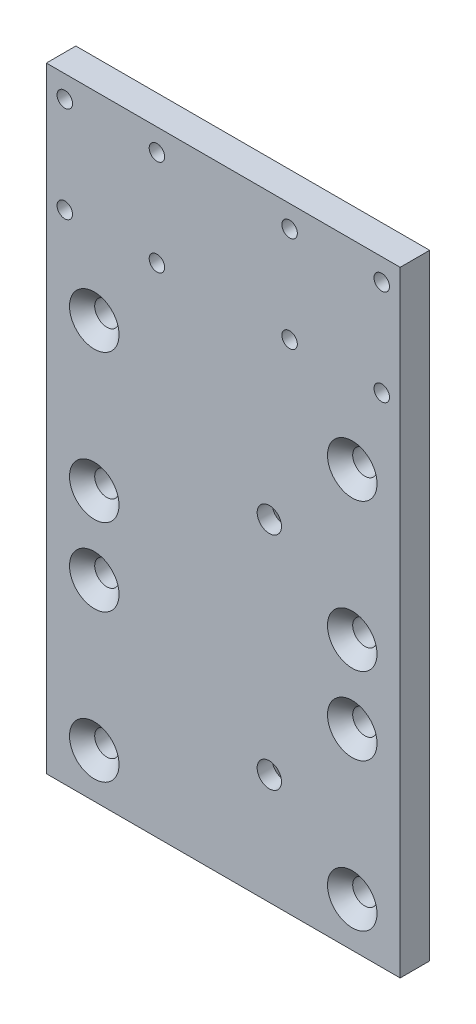
ISO-10303-21;
HEADER;
FILE_DESCRIPTION(('STEP AP214'),'2;1');
FILE_NAME('part.step','',(''),(''),'','','');
FILE_SCHEMA(('AUTOMOTIVE_DESIGN { 1 0 10303 214 1 1 1 1 }'));
ENDSEC;
DATA;
#1=APPLICATION_CONTEXT('core data for automotive mechanical design processes');
#2=APPLICATION_PROTOCOL_DEFINITION('international standard','automotive_design',2000,#1);
#3=PRODUCT_CONTEXT('',#1,'mechanical');
#4=PRODUCT('Part','Part','',(#3));
#5=PRODUCT_RELATED_PRODUCT_CATEGORY('part','',(#4));
#6=PRODUCT_DEFINITION_FORMATION('','',#4);
#7=PRODUCT_DEFINITION_CONTEXT('part definition',#1,'design');
#8=PRODUCT_DEFINITION('design','',#6,#7);
#9=PRODUCT_DEFINITION_SHAPE('','',#8);
#10=(LENGTH_UNIT() NAMED_UNIT(*) SI_UNIT(.MILLI.,.METRE.));
#11=(NAMED_UNIT(*) PLANE_ANGLE_UNIT() SI_UNIT($,.RADIAN.));
#12=(NAMED_UNIT(*) SI_UNIT($,.STERADIAN.) SOLID_ANGLE_UNIT());
#13=UNCERTAINTY_MEASURE_WITH_UNIT(LENGTH_MEASURE(1.E-05),#10,'distance_accuracy_value','');
#14=(GEOMETRIC_REPRESENTATION_CONTEXT(3) GLOBAL_UNCERTAINTY_ASSIGNED_CONTEXT((#13)) GLOBAL_UNIT_ASSIGNED_CONTEXT((#10,
#11,#12)) REPRESENTATION_CONTEXT('',''));
#15=CARTESIAN_POINT('',(0.,0.,0.));
#16=DIRECTION('',(0.,0.,1.));
#17=DIRECTION('',(1.,0.,0.));
#18=AXIS2_PLACEMENT_3D('',#15,#16,#17);
#19=CARTESIAN_POINT('',(20.,-60.,8.));
#20=DIRECTION('',(0.,0.,1.));
#21=DIRECTION('',(1.,0.,0.));
#22=AXIS2_PLACEMENT_3D('',#19,#20,#21);
#23=PLANE('',#22);
#24=CARTESIAN_POINT('',(12.5,30.,8.));
#25=DIRECTION('',(0.,0.,1.));
#26=DIRECTION('',(1.,0.,0.));
#27=AXIS2_PLACEMENT_3D('',#24,#25,#26);
#28=CIRCLE('',#27,3.3);
#29=CARTESIAN_POINT('',(15.8,30.,8.));
#30=VERTEX_POINT('',#29);
#31=EDGE_CURVE('E48',#30,#30,#28,.T.);
#32=ORIENTED_EDGE('',*,*,#31,.F.);
#33=EDGE_LOOP('',(#32));
#34=FACE_BOUND('',#33,.T.);
#35=CARTESIAN_POINT('',(12.5,-30.,8.));
#36=DIRECTION('',(0.,0.,1.));
#37=DIRECTION('',(1.,0.,0.));
#38=AXIS2_PLACEMENT_3D('',#35,#36,#37);
#39=CIRCLE('',#38,3.3);
#40=CARTESIAN_POINT('',(15.8,-30.,8.));
#41=VERTEX_POINT('',#40);
#42=EDGE_CURVE('E104',#41,#41,#39,.T.);
#43=ORIENTED_EDGE('',*,*,#42,.F.);
#44=EDGE_LOOP('',(#43));
#45=FACE_BOUND('',#44,.T.);
#46=DIRECTION('',(0.,-1.,0.));
#47=VECTOR('',#46,1.);
#48=CARTESIAN_POINT('',(-48.,-60.,8.));
#49=LINE('',#48,#47);
#50=CARTESIAN_POINT('',(-48.,107.,8.));
#51=VERTEX_POINT('',#50);
#52=CARTESIAN_POINT('',(-48.,-60.,8.));
#53=VERTEX_POINT('',#52);
#54=EDGE_CURVE('E96',#51,#53,#49,.T.);
#55=ORIENTED_EDGE('',*,*,#54,.T.);
#56=DIRECTION('',(1.,0.,0.));
#57=VECTOR('',#56,1.);
#58=CARTESIAN_POINT('',(-48.,-60.,8.));
#59=LINE('',#58,#57);
#60=CARTESIAN_POINT('',(48.,-60.,8.));
#61=VERTEX_POINT('',#60);
#62=EDGE_CURVE('E91',#53,#61,#59,.T.);
#63=ORIENTED_EDGE('',*,*,#62,.T.);
#64=DIRECTION('',(0.,1.,0.));
#65=VECTOR('',#64,1.);
#66=CARTESIAN_POINT('',(48.,-60.,8.));
#67=LINE('',#66,#65);
#68=CARTESIAN_POINT('',(48.,107.,8.));
#69=VERTEX_POINT('',#68);
#70=EDGE_CURVE('E63',#61,#69,#67,.T.);
#71=ORIENTED_EDGE('',*,*,#70,.T.);
#72=DIRECTION('',(-1.,0.,0.));
#73=VECTOR('',#72,1.);
#74=CARTESIAN_POINT('',(-48.,107.,8.));
#75=LINE('',#74,#73);
#76=EDGE_CURVE('E100',#69,#51,#75,.T.);
#77=ORIENTED_EDGE('',*,*,#76,.T.);
#78=EDGE_LOOP('',(#55,#63,#71,#77));
#79=FACE_BOUND('',#78,.T.);
#80=CARTESIAN_POINT('',(35.,53.,8.));
#81=DIRECTION('',(0.,0.,1.));
#82=DIRECTION('',(1.,0.,0.));
#83=AXIS2_PLACEMENT_3D('',#80,#81,#82);
#84=CIRCLE('',#83,6.72);
#85=CARTESIAN_POINT('',(41.72,53.,8.));
#86=VERTEX_POINT('',#85);
#87=EDGE_CURVE('E12',#86,#86,#84,.T.);
#88=ORIENTED_EDGE('',*,*,#87,.F.);
#89=EDGE_LOOP('',(#88));
#90=FACE_BOUND('',#89,.T.);
#91=CARTESIAN_POINT('',(35.,13.,8.));
#92=DIRECTION('',(0.,0.,1.));
#93=DIRECTION('',(1.,0.,0.));
#94=AXIS2_PLACEMENT_3D('',#91,#92,#93);
#95=CIRCLE('',#94,6.72);
#96=CARTESIAN_POINT('',(41.72,13.,8.));
#97=VERTEX_POINT('',#96);
#98=EDGE_CURVE('E234',#97,#97,#95,.T.);
#99=ORIENTED_EDGE('',*,*,#98,.F.);
#100=EDGE_LOOP('',(#99));
#101=FACE_BOUND('',#100,.T.);
#102=CARTESIAN_POINT('',(35.,-8.00000000000001,8.));
#103=DIRECTION('',(0.,0.,1.));
#104=DIRECTION('',(1.,0.,0.));
#105=AXIS2_PLACEMENT_3D('',#102,#103,#104);
#106=CIRCLE('',#105,6.72);
#107=CARTESIAN_POINT('',(41.72,-8.00000000000001,8.));
#108=VERTEX_POINT('',#107);
#109=EDGE_CURVE('E225',#108,#108,#106,.T.);
#110=ORIENTED_EDGE('',*,*,#109,.F.);
#111=EDGE_LOOP('',(#110));
#112=FACE_BOUND('',#111,.T.);
#113=CARTESIAN_POINT('',(35.,-48.,8.));
#114=DIRECTION('',(0.,0.,1.));
#115=DIRECTION('',(1.,0.,0.));
#116=AXIS2_PLACEMENT_3D('',#113,#114,#115);
#117=CIRCLE('',#116,6.72);
#118=CARTESIAN_POINT('',(41.72,-48.,8.));
#119=VERTEX_POINT('',#118);
#120=EDGE_CURVE('E216',#119,#119,#117,.T.);
#121=ORIENTED_EDGE('',*,*,#120,.F.);
#122=EDGE_LOOP('',(#121));
#123=FACE_BOUND('',#122,.T.);
#124=CARTESIAN_POINT('',(-43.0000000000005,101.000000000001,8.));
#125=DIRECTION('',(0.,0.,1.));
#126=DIRECTION('',(1.,0.,0.));
#127=AXIS2_PLACEMENT_3D('',#124,#125,#126);
#128=CIRCLE('',#127,2.1);
#129=CARTESIAN_POINT('',(-40.9000000000005,101.000000000001,8.));
#130=VERTEX_POINT('',#129);
#131=EDGE_CURVE('E207',#130,#130,#128,.T.);
#132=ORIENTED_EDGE('',*,*,#131,.F.);
#133=EDGE_LOOP('',(#132));
#134=FACE_BOUND('',#133,.T.);
#135=CARTESIAN_POINT('',(-43.0000000000005,75.0000000000006,8.));
#136=DIRECTION('',(0.,0.,1.));
#137=DIRECTION('',(1.,0.,0.));
#138=AXIS2_PLACEMENT_3D('',#135,#136,#137);
#139=CIRCLE('',#138,2.1);
#140=CARTESIAN_POINT('',(-40.9000000000005,75.0000000000006,8.));
#141=VERTEX_POINT('',#140);
#142=EDGE_CURVE('E201',#141,#141,#139,.T.);
#143=ORIENTED_EDGE('',*,*,#142,.F.);
#144=EDGE_LOOP('',(#143));
#145=FACE_BOUND('',#144,.T.);
#146=CARTESIAN_POINT('',(-18.0000000000005,101.000000000001,8.));
#147=DIRECTION('',(0.,0.,1.));
#148=DIRECTION('',(1.,0.,0.));
#149=AXIS2_PLACEMENT_3D('',#146,#147,#148);
#150=CIRCLE('',#149,2.1);
#151=CARTESIAN_POINT('',(-15.9000000000004,101.000000000001,8.));
#152=VERTEX_POINT('',#151);
#153=EDGE_CURVE('E195',#152,#152,#150,.T.);
#154=ORIENTED_EDGE('',*,*,#153,.F.);
#155=EDGE_LOOP('',(#154));
#156=FACE_BOUND('',#155,.T.);
#157=CARTESIAN_POINT('',(-18.0000000000005,75.0000000000006,8.));
#158=DIRECTION('',(0.,0.,1.));
#159=DIRECTION('',(1.,0.,0.));
#160=AXIS2_PLACEMENT_3D('',#157,#158,#159);
#161=CIRCLE('',#160,2.1);
#162=CARTESIAN_POINT('',(-15.9000000000004,75.0000000000006,8.));
#163=VERTEX_POINT('',#162);
#164=EDGE_CURVE('E189',#163,#163,#161,.T.);
#165=ORIENTED_EDGE('',*,*,#164,.F.);
#166=EDGE_LOOP('',(#165));
#167=FACE_BOUND('',#166,.T.);
#168=CARTESIAN_POINT('',(18.0000000000004,75.0000000000004,8.));
#169=DIRECTION('',(0.,0.,1.));
#170=DIRECTION('',(1.,0.,0.));
#171=AXIS2_PLACEMENT_3D('',#168,#169,#170);
#172=CIRCLE('',#171,2.1);
#173=CARTESIAN_POINT('',(20.1000000000004,75.0000000000004,8.));
#174=VERTEX_POINT('',#173);
#175=EDGE_CURVE('E183',#174,#174,#172,.T.);
#176=ORIENTED_EDGE('',*,*,#175,.F.);
#177=EDGE_LOOP('',(#176));
#178=FACE_BOUND('',#177,.T.);
#179=CARTESIAN_POINT('',(18.0000000000004,101.,8.));
#180=DIRECTION('',(0.,0.,1.));
#181=DIRECTION('',(1.,0.,0.));
#182=AXIS2_PLACEMENT_3D('',#179,#180,#181);
#183=CIRCLE('',#182,2.1);
#184=CARTESIAN_POINT('',(20.1000000000004,101.,8.));
#185=VERTEX_POINT('',#184);
#186=EDGE_CURVE('E177',#185,#185,#183,.T.);
#187=ORIENTED_EDGE('',*,*,#186,.F.);
#188=EDGE_LOOP('',(#187));
#189=FACE_BOUND('',#188,.T.);
#190=CARTESIAN_POINT('',(43.0000000000004,101.,8.));
#191=DIRECTION('',(0.,0.,1.));
#192=DIRECTION('',(1.,0.,0.));
#193=AXIS2_PLACEMENT_3D('',#190,#191,#192);
#194=CIRCLE('',#193,2.1);
#195=CARTESIAN_POINT('',(45.1000000000004,101.,8.));
#196=VERTEX_POINT('',#195);
#197=EDGE_CURVE('E171',#196,#196,#194,.T.);
#198=ORIENTED_EDGE('',*,*,#197,.F.);
#199=EDGE_LOOP('',(#198));
#200=FACE_BOUND('',#199,.T.);
#201=CARTESIAN_POINT('',(43.0000000000004,75.0000000000004,8.));
#202=DIRECTION('',(0.,0.,1.));
#203=DIRECTION('',(1.,0.,0.));
#204=AXIS2_PLACEMENT_3D('',#201,#202,#203);
#205=CIRCLE('',#204,2.1);
#206=CARTESIAN_POINT('',(45.1000000000004,75.0000000000004,8.));
#207=VERTEX_POINT('',#206);
#208=EDGE_CURVE('E165',#207,#207,#205,.T.);
#209=ORIENTED_EDGE('',*,*,#208,.F.);
#210=EDGE_LOOP('',(#209));
#211=FACE_BOUND('',#210,.T.);
#212=CARTESIAN_POINT('',(-35.,-48.,8.));
#213=DIRECTION('',(0.,0.,1.));
#214=DIRECTION('',(1.,0.,0.));
#215=AXIS2_PLACEMENT_3D('',#212,#213,#214);
#216=CIRCLE('',#215,6.72);
#217=CARTESIAN_POINT('',(-28.28,-48.,8.));
#218=VERTEX_POINT('',#217);
#219=EDGE_CURVE('E124',#218,#218,#216,.T.);
#220=ORIENTED_EDGE('',*,*,#219,.F.);
#221=EDGE_LOOP('',(#220));
#222=FACE_BOUND('',#221,.T.);
#223=CARTESIAN_POINT('',(-35.,-8.00000000000001,8.));
#224=DIRECTION('',(0.,0.,1.));
#225=DIRECTION('',(1.,0.,0.));
#226=AXIS2_PLACEMENT_3D('',#223,#224,#225);
#227=CIRCLE('',#226,6.72);
#228=CARTESIAN_POINT('',(-28.28,-8.00000000000001,8.));
#229=VERTEX_POINT('',#228);
#230=EDGE_CURVE('E133',#229,#229,#227,.T.);
#231=ORIENTED_EDGE('',*,*,#230,.F.);
#232=EDGE_LOOP('',(#231));
#233=FACE_BOUND('',#232,.T.);
#234=CARTESIAN_POINT('',(-35.,13.,8.));
#235=DIRECTION('',(0.,0.,1.));
#236=DIRECTION('',(1.,0.,0.));
#237=AXIS2_PLACEMENT_3D('',#234,#235,#236);
#238=CIRCLE('',#237,6.72);
#239=CARTESIAN_POINT('',(-28.28,13.,8.));
#240=VERTEX_POINT('',#239);
#241=EDGE_CURVE('E142',#240,#240,#238,.T.);
#242=ORIENTED_EDGE('',*,*,#241,.F.);
#243=EDGE_LOOP('',(#242));
#244=FACE_BOUND('',#243,.T.);
#245=CARTESIAN_POINT('',(-35.,53.,8.));
#246=DIRECTION('',(0.,0.,1.));
#247=DIRECTION('',(1.,0.,0.));
#248=AXIS2_PLACEMENT_3D('',#245,#246,#247);
#249=CIRCLE('',#248,6.72);
#250=CARTESIAN_POINT('',(-28.28,53.,8.));
#251=VERTEX_POINT('',#250);
#252=EDGE_CURVE('E151',#251,#251,#249,.T.);
#253=ORIENTED_EDGE('',*,*,#252,.F.);
#254=EDGE_LOOP('',(#253));
#255=FACE_BOUND('',#254,.T.);
#256=ADVANCED_FACE('F44',(#34,#45,#79,#90,#101,#112,#123,#134,#145,#156,#167,#178,#189,#200,
#211,#222,#233,#244,#255),#23,.T.);
#257=CARTESIAN_POINT('',(-35.,-48.,8.));
#258=DIRECTION('',(0.,0.,1.));
#259=DIRECTION('',(1.,0.,0.));
#260=AXIS2_PLACEMENT_3D('',#257,#258,#259);
#261=CYLINDRICAL_SURFACE('',#260,3.3);
#262=CARTESIAN_POINT('',(-35.,-48.,0.));
#263=DIRECTION('',(0.,0.,1.));
#264=DIRECTION('',(1.,0.,0.));
#265=AXIS2_PLACEMENT_3D('',#262,#263,#264);
#266=CIRCLE('',#265,3.3);
#267=CARTESIAN_POINT('',(-31.7,-48.,0.));
#268=VERTEX_POINT('',#267);
#269=EDGE_CURVE('E116',#268,#268,#266,.T.);
#270=ORIENTED_EDGE('',*,*,#269,.F.);
#271=EDGE_LOOP('',(#270));
#272=FACE_BOUND('',#271,.T.);
#273=CARTESIAN_POINT('',(-35.,-48.,4.58));
#274=DIRECTION('',(0.,0.,1.));
#275=DIRECTION('',(1.,0.,0.));
#276=AXIS2_PLACEMENT_3D('',#273,#274,#275);
#277=CIRCLE('',#276,3.3);
#278=CARTESIAN_POINT('',(-31.7,-48.,4.58));
#279=VERTEX_POINT('',#278);
#280=EDGE_CURVE('E121',#279,#279,#277,.T.);
#281=ORIENTED_EDGE('',*,*,#280,.T.);
#282=EDGE_LOOP('',(#281));
#283=FACE_BOUND('',#282,.T.);
#284=ADVANCED_FACE('F253',(#272,#283),#261,.F.);
#285=CARTESIAN_POINT('',(-35.,-48.,8.));
#286=DIRECTION('',(0.,0.,1.));
#287=DIRECTION('',(1.,0.,0.));
#288=AXIS2_PLACEMENT_3D('',#285,#286,#287);
#289=CONICAL_SURFACE('',#288,6.72,0.785398163397449);
#290=ORIENTED_EDGE('',*,*,#280,.F.);
#291=EDGE_LOOP('',(#290));
#292=FACE_BOUND('',#291,.T.);
#293=ORIENTED_EDGE('',*,*,#219,.T.);
#294=EDGE_LOOP('',(#293));
#295=FACE_BOUND('',#294,.T.);
#296=ADVANCED_FACE('F304',(#292,#295),#289,.F.);
#297=CARTESIAN_POINT('',(-35.,-8.00000000000001,8.));
#298=DIRECTION('',(0.,0.,1.));
#299=DIRECTION('',(1.,0.,0.));
#300=AXIS2_PLACEMENT_3D('',#297,#298,#299);
#301=CYLINDRICAL_SURFACE('',#300,3.3);
#302=CARTESIAN_POINT('',(-35.,-8.00000000000001,0.));
#303=DIRECTION('',(0.,0.,1.));
#304=DIRECTION('',(1.,0.,0.));
#305=AXIS2_PLACEMENT_3D('',#302,#303,#304);
#306=CIRCLE('',#305,3.3);
#307=CARTESIAN_POINT('',(-31.7,-8.00000000000001,0.));
#308=VERTEX_POINT('',#307);
#309=EDGE_CURVE('E127',#308,#308,#306,.T.);
#310=ORIENTED_EDGE('',*,*,#309,.F.);
#311=EDGE_LOOP('',(#310));
#312=FACE_BOUND('',#311,.T.);
#313=CARTESIAN_POINT('',(-35.,-8.00000000000001,4.58));
#314=DIRECTION('',(0.,0.,1.));
#315=DIRECTION('',(1.,0.,0.));
#316=AXIS2_PLACEMENT_3D('',#313,#314,#315);
#317=CIRCLE('',#316,3.3);
#318=CARTESIAN_POINT('',(-31.7,-8.00000000000001,4.58));
#319=VERTEX_POINT('',#318);
#320=EDGE_CURVE('E130',#319,#319,#317,.T.);
#321=ORIENTED_EDGE('',*,*,#320,.T.);
#322=EDGE_LOOP('',(#321));
#323=FACE_BOUND('',#322,.T.);
#324=ADVANCED_FACE('F310',(#312,#323),#301,.F.);
#325=CARTESIAN_POINT('',(-35.,-8.00000000000001,8.));
#326=DIRECTION('',(0.,0.,1.));
#327=DIRECTION('',(1.,0.,0.));
#328=AXIS2_PLACEMENT_3D('',#325,#326,#327);
#329=CONICAL_SURFACE('',#328,6.72,0.785398163397449);
#330=ORIENTED_EDGE('',*,*,#320,.F.);
#331=EDGE_LOOP('',(#330));
#332=FACE_BOUND('',#331,.T.);
#333=ORIENTED_EDGE('',*,*,#230,.T.);
#334=EDGE_LOOP('',(#333));
#335=FACE_BOUND('',#334,.T.);
#336=ADVANCED_FACE('F319',(#332,#335),#329,.F.);
#337=CARTESIAN_POINT('',(-35.,13.,8.));
#338=DIRECTION('',(0.,0.,1.));
#339=DIRECTION('',(1.,0.,0.));
#340=AXIS2_PLACEMENT_3D('',#337,#338,#339);
#341=CYLINDRICAL_SURFACE('',#340,3.3);
#342=CARTESIAN_POINT('',(-35.,13.,0.));
#343=DIRECTION('',(0.,0.,1.));
#344=DIRECTION('',(1.,0.,0.));
#345=AXIS2_PLACEMENT_3D('',#342,#343,#344);
#346=CIRCLE('',#345,3.3);
#347=CARTESIAN_POINT('',(-31.7,13.,0.));
#348=VERTEX_POINT('',#347);
#349=EDGE_CURVE('E136',#348,#348,#346,.T.);
#350=ORIENTED_EDGE('',*,*,#349,.F.);
#351=EDGE_LOOP('',(#350));
#352=FACE_BOUND('',#351,.T.);
#353=CARTESIAN_POINT('',(-35.,13.,4.58));
#354=DIRECTION('',(0.,0.,1.));
#355=DIRECTION('',(1.,0.,0.));
#356=AXIS2_PLACEMENT_3D('',#353,#354,#355);
#357=CIRCLE('',#356,3.3);
#358=CARTESIAN_POINT('',(-31.7,13.,4.58));
#359=VERTEX_POINT('',#358);
#360=EDGE_CURVE('E139',#359,#359,#357,.T.);
#361=ORIENTED_EDGE('',*,*,#360,.T.);
#362=EDGE_LOOP('',(#361));
#363=FACE_BOUND('',#362,.T.);
#364=ADVANCED_FACE('F323',(#352,#363),#341,.F.);
#365=CARTESIAN_POINT('',(-35.,13.,8.));
#366=DIRECTION('',(0.,0.,1.));
#367=DIRECTION('',(1.,0.,0.));
#368=AXIS2_PLACEMENT_3D('',#365,#366,#367);
#369=CONICAL_SURFACE('',#368,6.72,0.785398163397449);
#370=ORIENTED_EDGE('',*,*,#360,.F.);
#371=EDGE_LOOP('',(#370));
#372=FACE_BOUND('',#371,.T.);
#373=ORIENTED_EDGE('',*,*,#241,.T.);
#374=EDGE_LOOP('',(#373));
#375=FACE_BOUND('',#374,.T.);
#376=ADVANCED_FACE('F298',(#372,#375),#369,.F.);
#377=CARTESIAN_POINT('',(-35.,53.,8.));
#378=DIRECTION('',(0.,0.,1.));
#379=DIRECTION('',(1.,0.,0.));
#380=AXIS2_PLACEMENT_3D('',#377,#378,#379);
#381=CYLINDRICAL_SURFACE('',#380,3.3);
#382=CARTESIAN_POINT('',(-35.,53.,0.));
#383=DIRECTION('',(0.,0.,1.));
#384=DIRECTION('',(1.,0.,0.));
#385=AXIS2_PLACEMENT_3D('',#382,#383,#384);
#386=CIRCLE('',#385,3.3);
#387=CARTESIAN_POINT('',(-31.7,53.,0.));
#388=VERTEX_POINT('',#387);
#389=EDGE_CURVE('E145',#388,#388,#386,.T.);
#390=ORIENTED_EDGE('',*,*,#389,.F.);
#391=EDGE_LOOP('',(#390));
#392=FACE_BOUND('',#391,.T.);
#393=CARTESIAN_POINT('',(-35.,53.,4.58));
#394=DIRECTION('',(0.,0.,1.));
#395=DIRECTION('',(1.,0.,0.));
#396=AXIS2_PLACEMENT_3D('',#393,#394,#395);
#397=CIRCLE('',#396,3.3);
#398=CARTESIAN_POINT('',(-31.7,53.,4.58));
#399=VERTEX_POINT('',#398);
#400=EDGE_CURVE('E148',#399,#399,#397,.T.);
#401=ORIENTED_EDGE('',*,*,#400,.T.);
#402=EDGE_LOOP('',(#401));
#403=FACE_BOUND('',#402,.T.);
#404=ADVANCED_FACE('F289',(#392,#403),#381,.F.);
#405=CARTESIAN_POINT('',(-35.,53.,8.));
#406=DIRECTION('',(0.,0.,1.));
#407=DIRECTION('',(1.,0.,0.));
#408=AXIS2_PLACEMENT_3D('',#405,#406,#407);
#409=CONICAL_SURFACE('',#408,6.72,0.785398163397449);
#410=ORIENTED_EDGE('',*,*,#400,.F.);
#411=EDGE_LOOP('',(#410));
#412=FACE_BOUND('',#411,.T.);
#413=ORIENTED_EDGE('',*,*,#252,.T.);
#414=EDGE_LOOP('',(#413));
#415=FACE_BOUND('',#414,.T.);
#416=ADVANCED_FACE('F287',(#412,#415),#409,.F.);
#417=CARTESIAN_POINT('',(-48.,-60.,8.));
#418=DIRECTION('',(1.,0.,0.));
#419=DIRECTION('',(0.,0.,-1.));
#420=AXIS2_PLACEMENT_3D('',#417,#418,#419);
#421=PLANE('',#420);
#422=DIRECTION('',(0.,-1.,0.));
#423=VECTOR('',#422,1.);
#424=CARTESIAN_POINT('',(-48.,-60.,0.));
#425=LINE('',#424,#423);
#426=CARTESIAN_POINT('',(-48.,107.,0.));
#427=VERTEX_POINT('',#426);
#428=CARTESIAN_POINT('',(-48.,-60.,0.));
#429=VERTEX_POINT('',#428);
#430=EDGE_CURVE('E75',#427,#429,#425,.T.);
#431=ORIENTED_EDGE('',*,*,#430,.T.);
#432=DIRECTION('',(0.,0.,-1.));
#433=VECTOR('',#432,1.);
#434=CARTESIAN_POINT('',(-48.,-60.,8.));
#435=LINE('',#434,#433);
#436=EDGE_CURVE('E93',#53,#429,#435,.T.);
#437=ORIENTED_EDGE('',*,*,#436,.F.);
#438=ORIENTED_EDGE('',*,*,#54,.F.);
#439=DIRECTION('',(0.,0.,1.));
#440=VECTOR('',#439,1.);
#441=CARTESIAN_POINT('',(-48.,107.,0.));
#442=LINE('',#441,#440);
#443=EDGE_CURVE('E154',#427,#51,#442,.T.);
#444=ORIENTED_EDGE('',*,*,#443,.F.);
#445=EDGE_LOOP('',(#431,#437,#438,#444));
#446=FACE_BOUND('',#445,.T.);
#447=ADVANCED_FACE('F103',(#446),#421,.F.);
#448=CARTESIAN_POINT('',(0.,0.,0.));
#449=DIRECTION('',(0.,0.,-1.));
#450=DIRECTION('',(-1.,0.,0.));
#451=AXIS2_PLACEMENT_3D('',#448,#449,#450);
#452=PLANE('',#451);
#453=CARTESIAN_POINT('',(12.5,30.,0.));
#454=DIRECTION('',(0.,0.,-1.));
#455=DIRECTION('',(-1.,0.,0.));
#456=AXIS2_PLACEMENT_3D('',#453,#454,#455);
#457=CIRCLE('',#456,7.22);
#458=CARTESIAN_POINT('',(5.28,30.,0.));
#459=VERTEX_POINT('',#458);
#460=EDGE_CURVE('E615',#459,#459,#457,.T.);
#461=ORIENTED_EDGE('',*,*,#460,.F.);
#462=EDGE_LOOP('',(#461));
#463=FACE_BOUND('',#462,.T.);
#464=CARTESIAN_POINT('',(12.5,-30.,0.));
#465=DIRECTION('',(0.,0.,-1.));
#466=DIRECTION('',(-1.,0.,0.));
#467=AXIS2_PLACEMENT_3D('',#464,#465,#466);
#468=CIRCLE('',#467,7.22);
#469=CARTESIAN_POINT('',(5.27999999999998,-30.,0.));
#470=VERTEX_POINT('',#469);
#471=EDGE_CURVE('E618',#470,#470,#468,.T.);
#472=ORIENTED_EDGE('',*,*,#471,.F.);
#473=EDGE_LOOP('',(#472));
#474=FACE_BOUND('',#473,.T.);
#475=CARTESIAN_POINT('',(35.,53.,0.));
#476=DIRECTION('',(0.,0.,1.));
#477=DIRECTION('',(1.,0.,0.));
#478=AXIS2_PLACEMENT_3D('',#475,#476,#477);
#479=CIRCLE('',#478,3.3);
#480=CARTESIAN_POINT('',(38.3,53.,0.));
#481=VERTEX_POINT('',#480);
#482=EDGE_CURVE('E237',#481,#481,#479,.T.);
#483=ORIENTED_EDGE('',*,*,#482,.T.);
#484=EDGE_LOOP('',(#483));
#485=FACE_BOUND('',#484,.T.);
#486=CARTESIAN_POINT('',(35.,13.,0.));
#487=DIRECTION('',(0.,0.,1.));
#488=DIRECTION('',(1.,0.,0.));
#489=AXIS2_PLACEMENT_3D('',#486,#487,#488);
#490=CIRCLE('',#489,3.3);
#491=CARTESIAN_POINT('',(38.3,13.,0.));
#492=VERTEX_POINT('',#491);
#493=EDGE_CURVE('E228',#492,#492,#490,.T.);
#494=ORIENTED_EDGE('',*,*,#493,.T.);
#495=EDGE_LOOP('',(#494));
#496=FACE_BOUND('',#495,.T.);
#497=CARTESIAN_POINT('',(35.,-8.00000000000001,0.));
#498=DIRECTION('',(0.,0.,1.));
#499=DIRECTION('',(1.,0.,0.));
#500=AXIS2_PLACEMENT_3D('',#497,#498,#499);
#501=CIRCLE('',#500,3.3);
#502=CARTESIAN_POINT('',(38.3,-8.00000000000001,0.));
#503=VERTEX_POINT('',#502);
#504=EDGE_CURVE('E219',#503,#503,#501,.T.);
#505=ORIENTED_EDGE('',*,*,#504,.T.);
#506=EDGE_LOOP('',(#505));
#507=FACE_BOUND('',#506,.T.);
#508=CARTESIAN_POINT('',(35.,-48.,0.));
#509=DIRECTION('',(0.,0.,1.));
#510=DIRECTION('',(1.,0.,0.));
#511=AXIS2_PLACEMENT_3D('',#508,#509,#510);
#512=CIRCLE('',#511,3.3);
#513=CARTESIAN_POINT('',(38.3,-48.,0.));
#514=VERTEX_POINT('',#513);
#515=EDGE_CURVE('E210',#514,#514,#512,.T.);
#516=ORIENTED_EDGE('',*,*,#515,.T.);
#517=EDGE_LOOP('',(#516));
#518=FACE_BOUND('',#517,.T.);
#519=CARTESIAN_POINT('',(-43.0000000000005,101.000000000001,0.));
#520=DIRECTION('',(0.,0.,1.));
#521=DIRECTION('',(1.,0.,0.));
#522=AXIS2_PLACEMENT_3D('',#519,#520,#521);
#523=CIRCLE('',#522,2.1);
#524=CARTESIAN_POINT('',(-40.9000000000005,101.000000000001,0.));
#525=VERTEX_POINT('',#524);
#526=EDGE_CURVE('E204',#525,#525,#523,.T.);
#527=ORIENTED_EDGE('',*,*,#526,.T.);
#528=EDGE_LOOP('',(#527));
#529=FACE_BOUND('',#528,.T.);
#530=CARTESIAN_POINT('',(-43.0000000000005,75.0000000000006,0.));
#531=DIRECTION('',(0.,0.,1.));
#532=DIRECTION('',(1.,0.,0.));
#533=AXIS2_PLACEMENT_3D('',#530,#531,#532);
#534=CIRCLE('',#533,2.1);
#535=CARTESIAN_POINT('',(-40.9000000000005,75.0000000000006,0.));
#536=VERTEX_POINT('',#535);
#537=EDGE_CURVE('E198',#536,#536,#534,.T.);
#538=ORIENTED_EDGE('',*,*,#537,.T.);
#539=EDGE_LOOP('',(#538));
#540=FACE_BOUND('',#539,.T.);
#541=CARTESIAN_POINT('',(-18.0000000000005,101.000000000001,0.));
#542=DIRECTION('',(0.,0.,1.));
#543=DIRECTION('',(1.,0.,0.));
#544=AXIS2_PLACEMENT_3D('',#541,#542,#543);
#545=CIRCLE('',#544,2.1);
#546=CARTESIAN_POINT('',(-15.9000000000005,101.000000000001,0.));
#547=VERTEX_POINT('',#546);
#548=EDGE_CURVE('E192',#547,#547,#545,.T.);
#549=ORIENTED_EDGE('',*,*,#548,.T.);
#550=EDGE_LOOP('',(#549));
#551=FACE_BOUND('',#550,.T.);
#552=CARTESIAN_POINT('',(-18.0000000000005,75.0000000000006,0.));
#553=DIRECTION('',(0.,0.,1.));
#554=DIRECTION('',(1.,0.,0.));
#555=AXIS2_PLACEMENT_3D('',#552,#553,#554);
#556=CIRCLE('',#555,2.1);
#557=CARTESIAN_POINT('',(-15.9000000000005,75.0000000000006,0.));
#558=VERTEX_POINT('',#557);
#559=EDGE_CURVE('E186',#558,#558,#556,.T.);
#560=ORIENTED_EDGE('',*,*,#559,.T.);
#561=EDGE_LOOP('',(#560));
#562=FACE_BOUND('',#561,.T.);
#563=CARTESIAN_POINT('',(18.0000000000004,75.0000000000004,0.));
#564=DIRECTION('',(0.,0.,1.));
#565=DIRECTION('',(1.,0.,0.));
#566=AXIS2_PLACEMENT_3D('',#563,#564,#565);
#567=CIRCLE('',#566,2.1);
#568=CARTESIAN_POINT('',(20.1000000000004,75.0000000000004,0.));
#569=VERTEX_POINT('',#568);
#570=EDGE_CURVE('E180',#569,#569,#567,.T.);
#571=ORIENTED_EDGE('',*,*,#570,.T.);
#572=EDGE_LOOP('',(#571));
#573=FACE_BOUND('',#572,.T.);
#574=CARTESIAN_POINT('',(18.0000000000004,101.,0.));
#575=DIRECTION('',(0.,0.,1.));
#576=DIRECTION('',(1.,0.,0.));
#577=AXIS2_PLACEMENT_3D('',#574,#575,#576);
#578=CIRCLE('',#577,2.1);
#579=CARTESIAN_POINT('',(20.1000000000004,101.,0.));
#580=VERTEX_POINT('',#579);
#581=EDGE_CURVE('E174',#580,#580,#578,.T.);
#582=ORIENTED_EDGE('',*,*,#581,.T.);
#583=EDGE_LOOP('',(#582));
#584=FACE_BOUND('',#583,.T.);
#585=CARTESIAN_POINT('',(43.0000000000004,101.,0.));
#586=DIRECTION('',(0.,0.,1.));
#587=DIRECTION('',(1.,0.,0.));
#588=AXIS2_PLACEMENT_3D('',#585,#586,#587);
#589=CIRCLE('',#588,2.1);
#590=CARTESIAN_POINT('',(45.1000000000004,101.,0.));
#591=VERTEX_POINT('',#590);
#592=EDGE_CURVE('E168',#591,#591,#589,.T.);
#593=ORIENTED_EDGE('',*,*,#592,.T.);
#594=EDGE_LOOP('',(#593));
#595=FACE_BOUND('',#594,.T.);
#596=CARTESIAN_POINT('',(43.0000000000004,75.0000000000004,0.));
#597=DIRECTION('',(0.,0.,1.));
#598=DIRECTION('',(1.,0.,0.));
#599=AXIS2_PLACEMENT_3D('',#596,#597,#598);
#600=CIRCLE('',#599,2.1);
#601=CARTESIAN_POINT('',(45.1000000000004,75.0000000000004,0.));
#602=VERTEX_POINT('',#601);
#603=EDGE_CURVE('E160',#602,#602,#600,.T.);
#604=ORIENTED_EDGE('',*,*,#603,.T.);
#605=EDGE_LOOP('',(#604));
#606=FACE_BOUND('',#605,.T.);
#607=ORIENTED_EDGE('',*,*,#389,.T.);
#608=EDGE_LOOP('',(#607));
#609=FACE_BOUND('',#608,.T.);
#610=ORIENTED_EDGE('',*,*,#349,.T.);
#611=EDGE_LOOP('',(#610));
#612=FACE_BOUND('',#611,.T.);
#613=ORIENTED_EDGE('',*,*,#309,.T.);
#614=EDGE_LOOP('',(#613));
#615=FACE_BOUND('',#614,.T.);
#616=ORIENTED_EDGE('',*,*,#269,.T.);
#617=EDGE_LOOP('',(#616));
#618=FACE_BOUND('',#617,.T.);
#619=DIRECTION('',(0.,1.,0.));
#620=VECTOR('',#619,1.);
#621=CARTESIAN_POINT('',(48.,-60.,0.));
#622=LINE('',#621,#620);
#623=CARTESIAN_POINT('',(48.,-60.,0.));
#624=VERTEX_POINT('',#623);
#625=CARTESIAN_POINT('',(48.,107.,0.));
#626=VERTEX_POINT('',#625);
#627=EDGE_CURVE('E115',#624,#626,#622,.T.);
#628=ORIENTED_EDGE('',*,*,#627,.F.);
#629=DIRECTION('',(1.,0.,0.));
#630=VECTOR('',#629,1.);
#631=CARTESIAN_POINT('',(-48.,-60.,0.));
#632=LINE('',#631,#630);
#633=EDGE_CURVE('E112',#429,#624,#632,.T.);
#634=ORIENTED_EDGE('',*,*,#633,.F.);
#635=ORIENTED_EDGE('',*,*,#430,.F.);
#636=DIRECTION('',(-1.,0.,0.));
#637=VECTOR('',#636,1.);
#638=CARTESIAN_POINT('',(-48.,107.,0.));
#639=LINE('',#638,#637);
#640=EDGE_CURVE('E157',#626,#427,#639,.T.);
#641=ORIENTED_EDGE('',*,*,#640,.F.);
#642=EDGE_LOOP('',(#628,#634,#635,#641));
#643=FACE_BOUND('',#642,.T.);
#644=ADVANCED_FACE('F296',(#463,#474,#485,#496,#507,#518,#529,#540,#551,#562,#573,#584,#595,
#606,#609,#612,#615,#618,#643),#452,.T.);
#645=CARTESIAN_POINT('',(-43.0000000000005,101.000000000001,8.));
#646=DIRECTION('',(0.,0.,1.));
#647=DIRECTION('',(1.,0.,0.));
#648=AXIS2_PLACEMENT_3D('',#645,#646,#647);
#649=CYLINDRICAL_SURFACE('',#648,2.1);
#650=ORIENTED_EDGE('',*,*,#526,.F.);
#651=EDGE_LOOP('',(#650));
#652=FACE_BOUND('',#651,.T.);
#653=ORIENTED_EDGE('',*,*,#131,.T.);
#654=EDGE_LOOP('',(#653));
#655=FACE_BOUND('',#654,.T.);
#656=ADVANCED_FACE('F358',(#652,#655),#649,.F.);
#657=CARTESIAN_POINT('',(-43.0000000000005,75.0000000000006,8.));
#658=DIRECTION('',(0.,0.,1.));
#659=DIRECTION('',(1.,0.,0.));
#660=AXIS2_PLACEMENT_3D('',#657,#658,#659);
#661=CYLINDRICAL_SURFACE('',#660,2.1);
#662=ORIENTED_EDGE('',*,*,#537,.F.);
#663=EDGE_LOOP('',(#662));
#664=FACE_BOUND('',#663,.T.);
#665=ORIENTED_EDGE('',*,*,#142,.T.);
#666=EDGE_LOOP('',(#665));
#667=FACE_BOUND('',#666,.T.);
#668=ADVANCED_FACE('F364',(#664,#667),#661,.F.);
#669=CARTESIAN_POINT('',(-18.0000000000005,101.000000000001,8.));
#670=DIRECTION('',(0.,0.,1.));
#671=DIRECTION('',(1.,0.,0.));
#672=AXIS2_PLACEMENT_3D('',#669,#670,#671);
#673=CYLINDRICAL_SURFACE('',#672,2.1);
#674=ORIENTED_EDGE('',*,*,#548,.F.);
#675=EDGE_LOOP('',(#674));
#676=FACE_BOUND('',#675,.T.);
#677=ORIENTED_EDGE('',*,*,#153,.T.);
#678=EDGE_LOOP('',(#677));
#679=FACE_BOUND('',#678,.T.);
#680=ADVANCED_FACE('F378',(#676,#679),#673,.F.);
#681=CARTESIAN_POINT('',(-18.0000000000005,75.0000000000006,8.));
#682=DIRECTION('',(0.,0.,1.));
#683=DIRECTION('',(1.,0.,0.));
#684=AXIS2_PLACEMENT_3D('',#681,#682,#683);
#685=CYLINDRICAL_SURFACE('',#684,2.1);
#686=ORIENTED_EDGE('',*,*,#559,.F.);
#687=EDGE_LOOP('',(#686));
#688=FACE_BOUND('',#687,.T.);
#689=ORIENTED_EDGE('',*,*,#164,.T.);
#690=EDGE_LOOP('',(#689));
#691=FACE_BOUND('',#690,.T.);
#692=ADVANCED_FACE('F391',(#688,#691),#685,.F.);
#693=CARTESIAN_POINT('',(18.0000000000004,75.0000000000004,8.));
#694=DIRECTION('',(0.,0.,1.));
#695=DIRECTION('',(1.,0.,0.));
#696=AXIS2_PLACEMENT_3D('',#693,#694,#695);
#697=CYLINDRICAL_SURFACE('',#696,2.1);
#698=ORIENTED_EDGE('',*,*,#570,.F.);
#699=EDGE_LOOP('',(#698));
#700=FACE_BOUND('',#699,.T.);
#701=ORIENTED_EDGE('',*,*,#175,.T.);
#702=EDGE_LOOP('',(#701));
#703=FACE_BOUND('',#702,.T.);
#704=ADVANCED_FACE('F403',(#700,#703),#697,.F.);
#705=CARTESIAN_POINT('',(18.0000000000004,101.,8.));
#706=DIRECTION('',(0.,0.,1.));
#707=DIRECTION('',(1.,0.,0.));
#708=AXIS2_PLACEMENT_3D('',#705,#706,#707);
#709=CYLINDRICAL_SURFACE('',#708,2.1);
#710=ORIENTED_EDGE('',*,*,#581,.F.);
#711=EDGE_LOOP('',(#710));
#712=FACE_BOUND('',#711,.T.);
#713=ORIENTED_EDGE('',*,*,#186,.T.);
#714=EDGE_LOOP('',(#713));
#715=FACE_BOUND('',#714,.T.);
#716=ADVANCED_FACE('F415',(#712,#715),#709,.F.);
#717=CARTESIAN_POINT('',(43.0000000000004,101.,8.));
#718=DIRECTION('',(0.,0.,1.));
#719=DIRECTION('',(1.,0.,0.));
#720=AXIS2_PLACEMENT_3D('',#717,#718,#719);
#721=CYLINDRICAL_SURFACE('',#720,2.1);
#722=ORIENTED_EDGE('',*,*,#592,.F.);
#723=EDGE_LOOP('',(#722));
#724=FACE_BOUND('',#723,.T.);
#725=ORIENTED_EDGE('',*,*,#197,.T.);
#726=EDGE_LOOP('',(#725));
#727=FACE_BOUND('',#726,.T.);
#728=ADVANCED_FACE('F427',(#724,#727),#721,.F.);
#729=CARTESIAN_POINT('',(43.0000000000004,75.0000000000004,8.));
#730=DIRECTION('',(0.,0.,1.));
#731=DIRECTION('',(1.,0.,0.));
#732=AXIS2_PLACEMENT_3D('',#729,#730,#731);
#733=CYLINDRICAL_SURFACE('',#732,2.1);
#734=ORIENTED_EDGE('',*,*,#603,.F.);
#735=EDGE_LOOP('',(#734));
#736=FACE_BOUND('',#735,.T.);
#737=ORIENTED_EDGE('',*,*,#208,.T.);
#738=EDGE_LOOP('',(#737));
#739=FACE_BOUND('',#738,.T.);
#740=ADVANCED_FACE('F438',(#736,#739),#733,.F.);
#741=CARTESIAN_POINT('',(48.,-60.,8.));
#742=DIRECTION('',(-1.,0.,0.));
#743=DIRECTION('',(0.,0.,1.));
#744=AXIS2_PLACEMENT_3D('',#741,#742,#743);
#745=PLANE('',#744);
#746=ORIENTED_EDGE('',*,*,#627,.T.);
#747=DIRECTION('',(0.,0.,1.));
#748=VECTOR('',#747,1.);
#749=CARTESIAN_POINT('',(48.,107.,0.));
#750=LINE('',#749,#748);
#751=EDGE_CURVE('E155',#626,#69,#750,.T.);
#752=ORIENTED_EDGE('',*,*,#751,.T.);
#753=ORIENTED_EDGE('',*,*,#70,.F.);
#754=DIRECTION('',(0.,0.,-1.));
#755=VECTOR('',#754,1.);
#756=CARTESIAN_POINT('',(48.,-60.,8.));
#757=LINE('',#756,#755);
#758=EDGE_CURVE('E95',#61,#624,#757,.T.);
#759=ORIENTED_EDGE('',*,*,#758,.T.);
#760=EDGE_LOOP('',(#746,#752,#753,#759));
#761=FACE_BOUND('',#760,.T.);
#762=ADVANCED_FACE('F449',(#761),#745,.F.);
#763=CARTESIAN_POINT('',(-48.,107.,0.));
#764=DIRECTION('',(0.,1.,0.));
#765=DIRECTION('',(0.,0.,1.));
#766=AXIS2_PLACEMENT_3D('',#763,#764,#765);
#767=PLANE('',#766);
#768=ORIENTED_EDGE('',*,*,#76,.F.);
#769=ORIENTED_EDGE('',*,*,#751,.F.);
#770=ORIENTED_EDGE('',*,*,#640,.T.);
#771=ORIENTED_EDGE('',*,*,#443,.T.);
#772=EDGE_LOOP('',(#768,#769,#770,#771));
#773=FACE_BOUND('',#772,.T.);
#774=ADVANCED_FACE('F460',(#773),#767,.T.);
#775=CARTESIAN_POINT('',(-48.,-60.,8.));
#776=DIRECTION('',(0.,1.,0.));
#777=DIRECTION('',(0.,0.,1.));
#778=AXIS2_PLACEMENT_3D('',#775,#776,#777);
#779=PLANE('',#778);
#780=ORIENTED_EDGE('',*,*,#62,.F.);
#781=ORIENTED_EDGE('',*,*,#436,.T.);
#782=ORIENTED_EDGE('',*,*,#633,.T.);
#783=ORIENTED_EDGE('',*,*,#758,.F.);
#784=EDGE_LOOP('',(#780,#781,#782,#783));
#785=FACE_BOUND('',#784,.T.);
#786=ADVANCED_FACE('F46',(#785),#779,.F.);
#787=CARTESIAN_POINT('',(35.,53.,8.));
#788=DIRECTION('',(0.,0.,1.));
#789=DIRECTION('',(1.,0.,0.));
#790=AXIS2_PLACEMENT_3D('',#787,#788,#789);
#791=CYLINDRICAL_SURFACE('',#790,3.3);
#792=ORIENTED_EDGE('',*,*,#482,.F.);
#793=EDGE_LOOP('',(#792));
#794=FACE_BOUND('',#793,.T.);
#795=CARTESIAN_POINT('',(35.,53.,4.58));
#796=DIRECTION('',(0.,0.,1.));
#797=DIRECTION('',(1.,0.,0.));
#798=AXIS2_PLACEMENT_3D('',#795,#796,#797);
#799=CIRCLE('',#798,3.3);
#800=CARTESIAN_POINT('',(38.3,53.,4.58));
#801=VERTEX_POINT('',#800);
#802=EDGE_CURVE('E54',#801,#801,#799,.T.);
#803=ORIENTED_EDGE('',*,*,#802,.T.);
#804=EDGE_LOOP('',(#803));
#805=FACE_BOUND('',#804,.T.);
#806=ADVANCED_FACE('F243',(#794,#805),#791,.F.);
#807=CARTESIAN_POINT('',(35.,53.,8.));
#808=DIRECTION('',(0.,0.,1.));
#809=DIRECTION('',(1.,0.,0.));
#810=AXIS2_PLACEMENT_3D('',#807,#808,#809);
#811=CONICAL_SURFACE('',#810,6.72,0.785398163397449);
#812=ORIENTED_EDGE('',*,*,#802,.F.);
#813=EDGE_LOOP('',(#812));
#814=FACE_BOUND('',#813,.T.);
#815=ORIENTED_EDGE('',*,*,#87,.T.);
#816=EDGE_LOOP('',(#815));
#817=FACE_BOUND('',#816,.T.);
#818=ADVANCED_FACE('F245',(#814,#817),#811,.F.);
#819=CARTESIAN_POINT('',(35.,13.,8.));
#820=DIRECTION('',(0.,0.,1.));
#821=DIRECTION('',(1.,0.,0.));
#822=AXIS2_PLACEMENT_3D('',#819,#820,#821);
#823=CYLINDRICAL_SURFACE('',#822,3.3);
#824=ORIENTED_EDGE('',*,*,#493,.F.);
#825=EDGE_LOOP('',(#824));
#826=FACE_BOUND('',#825,.T.);
#827=CARTESIAN_POINT('',(35.,13.,4.58));
#828=DIRECTION('',(0.,0.,1.));
#829=DIRECTION('',(1.,0.,0.));
#830=AXIS2_PLACEMENT_3D('',#827,#828,#829);
#831=CIRCLE('',#830,3.3);
#832=CARTESIAN_POINT('',(38.3,13.,4.58));
#833=VERTEX_POINT('',#832);
#834=EDGE_CURVE('E231',#833,#833,#831,.T.);
#835=ORIENTED_EDGE('',*,*,#834,.T.);
#836=EDGE_LOOP('',(#835));
#837=FACE_BOUND('',#836,.T.);
#838=ADVANCED_FACE('F248',(#826,#837),#823,.F.);
#839=CARTESIAN_POINT('',(35.,13.,8.));
#840=DIRECTION('',(0.,0.,1.));
#841=DIRECTION('',(1.,0.,0.));
#842=AXIS2_PLACEMENT_3D('',#839,#840,#841);
#843=CONICAL_SURFACE('',#842,6.72,0.785398163397449);
#844=ORIENTED_EDGE('',*,*,#834,.F.);
#845=EDGE_LOOP('',(#844));
#846=FACE_BOUND('',#845,.T.);
#847=ORIENTED_EDGE('',*,*,#98,.T.);
#848=EDGE_LOOP('',(#847));
#849=FACE_BOUND('',#848,.T.);
#850=ADVANCED_FACE('F502',(#846,#849),#843,.F.);
#851=CARTESIAN_POINT('',(35.,-8.00000000000001,8.));
#852=DIRECTION('',(0.,0.,1.));
#853=DIRECTION('',(1.,0.,0.));
#854=AXIS2_PLACEMENT_3D('',#851,#852,#853);
#855=CYLINDRICAL_SURFACE('',#854,3.3);
#856=ORIENTED_EDGE('',*,*,#504,.F.);
#857=EDGE_LOOP('',(#856));
#858=FACE_BOUND('',#857,.T.);
#859=CARTESIAN_POINT('',(35.,-8.00000000000001,4.58));
#860=DIRECTION('',(0.,0.,1.));
#861=DIRECTION('',(1.,0.,0.));
#862=AXIS2_PLACEMENT_3D('',#859,#860,#861);
#863=CIRCLE('',#862,3.3);
#864=CARTESIAN_POINT('',(38.3,-8.00000000000001,4.58));
#865=VERTEX_POINT('',#864);
#866=EDGE_CURVE('E222',#865,#865,#863,.T.);
#867=ORIENTED_EDGE('',*,*,#866,.T.);
#868=EDGE_LOOP('',(#867));
#869=FACE_BOUND('',#868,.T.);
#870=ADVANCED_FACE('F512',(#858,#869),#855,.F.);
#871=CARTESIAN_POINT('',(35.,-8.00000000000001,8.));
#872=DIRECTION('',(0.,0.,1.));
#873=DIRECTION('',(1.,0.,0.));
#874=AXIS2_PLACEMENT_3D('',#871,#872,#873);
#875=CONICAL_SURFACE('',#874,6.72,0.785398163397449);
#876=ORIENTED_EDGE('',*,*,#866,.F.);
#877=EDGE_LOOP('',(#876));
#878=FACE_BOUND('',#877,.T.);
#879=ORIENTED_EDGE('',*,*,#109,.T.);
#880=EDGE_LOOP('',(#879));
#881=FACE_BOUND('',#880,.T.);
#882=ADVANCED_FACE('F522',(#878,#881),#875,.F.);
#883=CARTESIAN_POINT('',(35.,-48.,8.));
#884=DIRECTION('',(0.,0.,1.));
#885=DIRECTION('',(1.,0.,0.));
#886=AXIS2_PLACEMENT_3D('',#883,#884,#885);
#887=CYLINDRICAL_SURFACE('',#886,3.3);
#888=ORIENTED_EDGE('',*,*,#515,.F.);
#889=EDGE_LOOP('',(#888));
#890=FACE_BOUND('',#889,.T.);
#891=CARTESIAN_POINT('',(35.,-48.,4.58));
#892=DIRECTION('',(0.,0.,1.));
#893=DIRECTION('',(1.,0.,0.));
#894=AXIS2_PLACEMENT_3D('',#891,#892,#893);
#895=CIRCLE('',#894,3.3);
#896=CARTESIAN_POINT('',(38.3,-48.,4.58));
#897=VERTEX_POINT('',#896);
#898=EDGE_CURVE('E213',#897,#897,#895,.T.);
#899=ORIENTED_EDGE('',*,*,#898,.T.);
#900=EDGE_LOOP('',(#899));
#901=FACE_BOUND('',#900,.T.);
#902=ADVANCED_FACE('F532',(#890,#901),#887,.F.);
#903=CARTESIAN_POINT('',(35.,-48.,8.));
#904=DIRECTION('',(0.,0.,1.));
#905=DIRECTION('',(1.,0.,0.));
#906=AXIS2_PLACEMENT_3D('',#903,#904,#905);
#907=CONICAL_SURFACE('',#906,6.72,0.785398163397449);
#908=ORIENTED_EDGE('',*,*,#898,.F.);
#909=EDGE_LOOP('',(#908));
#910=FACE_BOUND('',#909,.T.);
#911=ORIENTED_EDGE('',*,*,#120,.T.);
#912=EDGE_LOOP('',(#911));
#913=FACE_BOUND('',#912,.T.);
#914=ADVANCED_FACE('F256',(#910,#913),#907,.F.);
#915=CARTESIAN_POINT('',(12.5,-30.,0.));
#916=DIRECTION('',(0.,0.,-1.));
#917=DIRECTION('',(-1.,0.,0.));
#918=AXIS2_PLACEMENT_3D('',#915,#916,#917);
#919=CYLINDRICAL_SURFACE('',#918,3.3);
#920=ORIENTED_EDGE('',*,*,#42,.T.);
#921=EDGE_LOOP('',(#920));
#922=FACE_BOUND('',#921,.T.);
#923=CARTESIAN_POINT('',(12.5,-30.,3.92));
#924=DIRECTION('',(0.,0.,-1.));
#925=DIRECTION('',(-1.,0.,0.));
#926=AXIS2_PLACEMENT_3D('',#923,#924,#925);
#927=CIRCLE('',#926,3.3);
#928=CARTESIAN_POINT('',(9.19999999999999,-30.,3.92));
#929=VERTEX_POINT('',#928);
#930=EDGE_CURVE('E108',#929,#929,#927,.T.);
#931=ORIENTED_EDGE('',*,*,#930,.T.);
#932=EDGE_LOOP('',(#931));
#933=FACE_BOUND('',#932,.T.);
#934=ADVANCED_FACE('F255',(#922,#933),#919,.F.);
#935=CARTESIAN_POINT('',(12.5,-30.,0.));
#936=DIRECTION('',(0.,0.,-1.));
#937=DIRECTION('',(-1.,0.,0.));
#938=AXIS2_PLACEMENT_3D('',#935,#936,#937);
#939=CONICAL_SURFACE('',#938,7.22,0.785398163397449);
#940=ORIENTED_EDGE('',*,*,#930,.F.);
#941=EDGE_LOOP('',(#940));
#942=FACE_BOUND('',#941,.T.);
#943=ORIENTED_EDGE('',*,*,#471,.T.);
#944=EDGE_LOOP('',(#943));
#945=FACE_BOUND('',#944,.T.);
#946=ADVANCED_FACE('F574',(#942,#945),#939,.F.);
#947=CARTESIAN_POINT('',(12.5,30.,0.));
#948=DIRECTION('',(0.,0.,-1.));
#949=DIRECTION('',(-1.,0.,0.));
#950=AXIS2_PLACEMENT_3D('',#947,#948,#949);
#951=CYLINDRICAL_SURFACE('',#950,3.3);
#952=ORIENTED_EDGE('',*,*,#31,.T.);
#953=EDGE_LOOP('',(#952));
#954=FACE_BOUND('',#953,.T.);
#955=CARTESIAN_POINT('',(12.5,30.,3.92));
#956=DIRECTION('',(0.,0.,-1.));
#957=DIRECTION('',(-1.,0.,0.));
#958=AXIS2_PLACEMENT_3D('',#955,#956,#957);
#959=CIRCLE('',#958,3.3);
#960=CARTESIAN_POINT('',(9.2,30.,3.92));
#961=VERTEX_POINT('',#960);
#962=EDGE_CURVE('E612',#961,#961,#959,.T.);
#963=ORIENTED_EDGE('',*,*,#962,.T.);
#964=EDGE_LOOP('',(#963));
#965=FACE_BOUND('',#964,.T.);
#966=ADVANCED_FACE('F585',(#954,#965),#951,.F.);
#967=CARTESIAN_POINT('',(12.5,30.,0.));
#968=DIRECTION('',(0.,0.,-1.));
#969=DIRECTION('',(-1.,0.,0.));
#970=AXIS2_PLACEMENT_3D('',#967,#968,#969);
#971=CONICAL_SURFACE('',#970,7.22,0.785398163397448);
#972=ORIENTED_EDGE('',*,*,#962,.F.);
#973=EDGE_LOOP('',(#972));
#974=FACE_BOUND('',#973,.T.);
#975=ORIENTED_EDGE('',*,*,#460,.T.);
#976=EDGE_LOOP('',(#975));
#977=FACE_BOUND('',#976,.T.);
#978=ADVANCED_FACE('F595',(#974,#977),#971,.F.);
#979=CLOSED_SHELL('',(#256,#284,#296,#324,#336,#364,#376,#404,#416,#447,#644,#656,#668,#680,
#692,#704,#716,#728,#740,#762,#774,#786,#806,#818,#838,#850,#870,#882,#902,#914,#934,#946,#966,#978));
#980=MANIFOLD_SOLID_BREP('B2',#979);
#981=ADVANCED_BREP_SHAPE_REPRESENTATION('',(#18,#980),#14);
#982=SHAPE_DEFINITION_REPRESENTATION(#9,#981);
ENDSEC;
END-ISO-10303-21;
